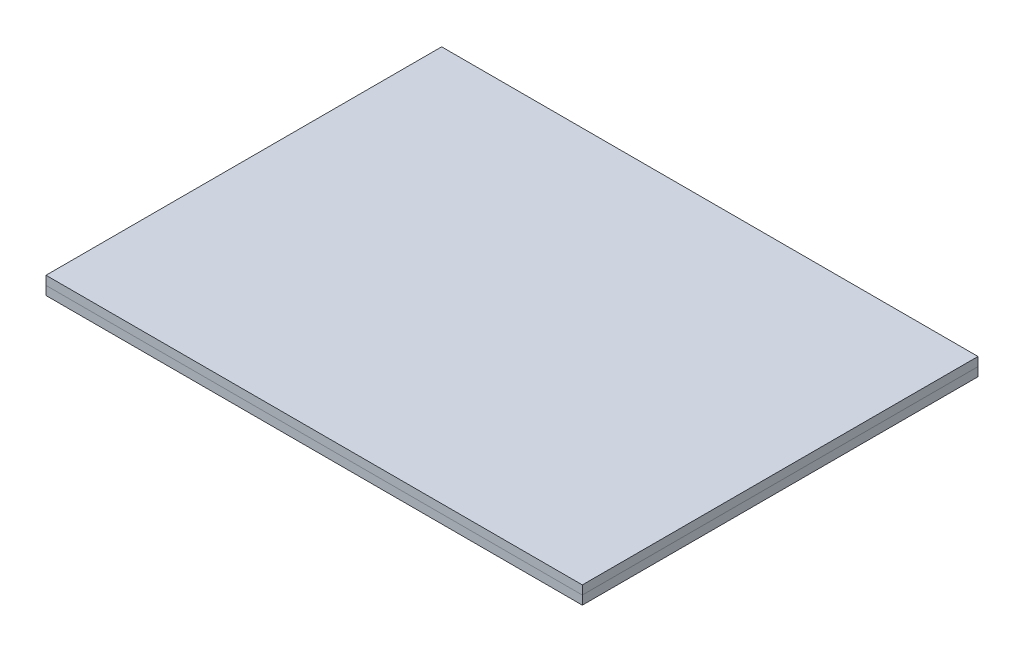
ISO-10303-21;
HEADER;
FILE_DESCRIPTION(('STEP AP214'),'2;1');
FILE_NAME('part.step','',(''),(''),'','','');
FILE_SCHEMA(('AUTOMOTIVE_DESIGN { 1 0 10303 214 1 1 1 1 }'));
ENDSEC;
DATA;
#1=APPLICATION_CONTEXT('core data for automotive mechanical design processes');
#2=APPLICATION_PROTOCOL_DEFINITION('international standard','automotive_design',2000,#1);
#3=PRODUCT_CONTEXT('',#1,'mechanical');
#4=PRODUCT('Part','Part','',(#3));
#5=PRODUCT_RELATED_PRODUCT_CATEGORY('part','',(#4));
#6=PRODUCT_DEFINITION_FORMATION('','',#4);
#7=PRODUCT_DEFINITION_CONTEXT('part definition',#1,'design');
#8=PRODUCT_DEFINITION('design','',#6,#7);
#9=PRODUCT_DEFINITION_SHAPE('','',#8);
#10=(LENGTH_UNIT() NAMED_UNIT(*) SI_UNIT(.MILLI.,.METRE.));
#11=(NAMED_UNIT(*) PLANE_ANGLE_UNIT() SI_UNIT($,.RADIAN.));
#12=(NAMED_UNIT(*) SI_UNIT($,.STERADIAN.) SOLID_ANGLE_UNIT());
#13=UNCERTAINTY_MEASURE_WITH_UNIT(LENGTH_MEASURE(1.E-05),#10,'distance_accuracy_value','');
#14=(GEOMETRIC_REPRESENTATION_CONTEXT(3) GLOBAL_UNCERTAINTY_ASSIGNED_CONTEXT((#13)) GLOBAL_UNIT_ASSIGNED_CONTEXT((#10,
#11,#12)) REPRESENTATION_CONTEXT('',''));
#15=CARTESIAN_POINT('',(0.,0.,0.));
#16=DIRECTION('',(0.,0.,1.));
#17=DIRECTION('',(1.,0.,0.));
#18=AXIS2_PLACEMENT_3D('',#15,#16,#17);
#19=CARTESIAN_POINT('',(0.,2.,29.9059304703476));
#20=DIRECTION('',(0.,0.,1.));
#21=DIRECTION('',(1.,0.,0.));
#22=AXIS2_PLACEMENT_3D('',#19,#20,#21);
#23=PLANE('',#22);
#24=DIRECTION('',(-1.,0.,0.));
#25=VECTOR('',#24,1.);
#26=CARTESIAN_POINT('',(0.,1.,29.9059304703476));
#27=LINE('',#26,#25);
#28=CARTESIAN_POINT('',(33.4314928425358,1.,29.9059304703476));
#29=VERTEX_POINT('',#28);
#30=CARTESIAN_POINT('',(-27.5685071574642,1.,29.9059304703476));
#31=VERTEX_POINT('',#30);
#32=EDGE_CURVE('E109',#29,#31,#27,.T.);
#33=ORIENTED_EDGE('',*,*,#32,.F.);
#34=DIRECTION('',(0.,-1.,0.));
#35=VECTOR('',#34,1.);
#36=CARTESIAN_POINT('',(33.4314928425358,2.,29.9059304703476));
#37=LINE('',#36,#35);
#38=CARTESIAN_POINT('',(33.4314928425358,2.,29.9059304703476));
#39=VERTEX_POINT('',#38);
#40=EDGE_CURVE('E12',#39,#29,#37,.T.);
#41=ORIENTED_EDGE('',*,*,#40,.F.);
#42=DIRECTION('',(-1.,0.,0.));
#43=VECTOR('',#42,1.);
#44=CARTESIAN_POINT('',(0.,2.,29.9059304703476));
#45=LINE('',#44,#43);
#46=CARTESIAN_POINT('',(-27.5685071574642,2.,29.9059304703476));
#47=VERTEX_POINT('',#46);
#48=EDGE_CURVE('E103',#39,#47,#45,.T.);
#49=ORIENTED_EDGE('',*,*,#48,.T.);
#50=DIRECTION('',(0.,-1.,0.));
#51=VECTOR('',#50,1.);
#52=CARTESIAN_POINT('',(-27.5685071574642,2.,29.9059304703476));
#53=LINE('',#52,#51);
#54=EDGE_CURVE('E48',#47,#31,#53,.T.);
#55=ORIENTED_EDGE('',*,*,#54,.T.);
#56=EDGE_LOOP('',(#33,#41,#49,#55));
#57=FACE_BOUND('',#56,.T.);
#58=ADVANCED_FACE('F45',(#57),#23,.T.);
#59=CARTESIAN_POINT('',(33.4314928425358,2.,0.));
#60=DIRECTION('',(1.,0.,0.));
#61=DIRECTION('',(0.,0.,-1.));
#62=AXIS2_PLACEMENT_3D('',#59,#60,#61);
#63=PLANE('',#62);
#64=DIRECTION('',(0.,0.,1.));
#65=VECTOR('',#64,1.);
#66=CARTESIAN_POINT('',(33.4314928425358,1.,0.));
#67=LINE('',#66,#65);
#68=CARTESIAN_POINT('',(33.4314928425358,1.,-15.0940695296524));
#69=VERTEX_POINT('',#68);
#70=EDGE_CURVE('E105',#69,#29,#67,.T.);
#71=ORIENTED_EDGE('',*,*,#70,.F.);
#72=DIRECTION('',(0.,-1.,0.));
#73=VECTOR('',#72,1.);
#74=CARTESIAN_POINT('',(33.4314928425358,2.,-15.0940695296524));
#75=LINE('',#74,#73);
#76=CARTESIAN_POINT('',(33.4314928425358,2.,-15.0940695296524));
#77=VERTEX_POINT('',#76);
#78=EDGE_CURVE('E54',#77,#69,#75,.T.);
#79=ORIENTED_EDGE('',*,*,#78,.F.);
#80=DIRECTION('',(0.,0.,1.));
#81=VECTOR('',#80,1.);
#82=CARTESIAN_POINT('',(33.4314928425358,2.,0.));
#83=LINE('',#82,#81);
#84=EDGE_CURVE('E100',#77,#39,#83,.T.);
#85=ORIENTED_EDGE('',*,*,#84,.T.);
#86=ORIENTED_EDGE('',*,*,#40,.T.);
#87=EDGE_LOOP('',(#71,#79,#85,#86));
#88=FACE_BOUND('',#87,.T.);
#89=ADVANCED_FACE('F119',(#88),#63,.T.);
#90=CARTESIAN_POINT('',(0.,2.,-15.0940695296524));
#91=DIRECTION('',(0.,0.,-1.));
#92=DIRECTION('',(-1.,0.,0.));
#93=AXIS2_PLACEMENT_3D('',#90,#91,#92);
#94=PLANE('',#93);
#95=DIRECTION('',(1.,0.,0.));
#96=VECTOR('',#95,1.);
#97=CARTESIAN_POINT('',(0.,1.,-15.0940695296524));
#98=LINE('',#97,#96);
#99=CARTESIAN_POINT('',(-27.5685071574642,1.,-15.0940695296524));
#100=VERTEX_POINT('',#99);
#101=EDGE_CURVE('E95',#100,#69,#98,.T.);
#102=ORIENTED_EDGE('',*,*,#101,.F.);
#103=DIRECTION('',(0.,-1.,0.));
#104=VECTOR('',#103,1.);
#105=CARTESIAN_POINT('',(-27.5685071574642,2.,-15.0940695296524));
#106=LINE('',#105,#104);
#107=CARTESIAN_POINT('',(-27.5685071574642,2.,-15.0940695296524));
#108=VERTEX_POINT('',#107);
#109=EDGE_CURVE('E90',#108,#100,#106,.T.);
#110=ORIENTED_EDGE('',*,*,#109,.F.);
#111=DIRECTION('',(1.,0.,0.));
#112=VECTOR('',#111,1.);
#113=CARTESIAN_POINT('',(0.,2.,-15.0940695296524));
#114=LINE('',#113,#112);
#115=EDGE_CURVE('E93',#108,#77,#114,.T.);
#116=ORIENTED_EDGE('',*,*,#115,.T.);
#117=ORIENTED_EDGE('',*,*,#78,.T.);
#118=EDGE_LOOP('',(#102,#110,#116,#117));
#119=FACE_BOUND('',#118,.T.);
#120=ADVANCED_FACE('F92',(#119),#94,.T.);
#121=CARTESIAN_POINT('',(-27.5685071574642,2.,0.));
#122=DIRECTION('',(-1.,0.,0.));
#123=DIRECTION('',(0.,0.,1.));
#124=AXIS2_PLACEMENT_3D('',#121,#122,#123);
#125=PLANE('',#124);
#126=DIRECTION('',(0.,0.,-1.));
#127=VECTOR('',#126,1.);
#128=CARTESIAN_POINT('',(-27.5685071574642,1.,0.));
#129=LINE('',#128,#127);
#130=EDGE_CURVE('E112',#31,#100,#129,.T.);
#131=ORIENTED_EDGE('',*,*,#130,.F.);
#132=ORIENTED_EDGE('',*,*,#54,.F.);
#133=DIRECTION('',(0.,0.,-1.));
#134=VECTOR('',#133,1.);
#135=CARTESIAN_POINT('',(-27.5685071574642,2.,0.));
#136=LINE('',#135,#134);
#137=EDGE_CURVE('E99',#47,#108,#136,.T.);
#138=ORIENTED_EDGE('',*,*,#137,.T.);
#139=ORIENTED_EDGE('',*,*,#109,.T.);
#140=EDGE_LOOP('',(#131,#132,#138,#139));
#141=FACE_BOUND('',#140,.T.);
#142=ADVANCED_FACE('F102',(#141),#125,.T.);
#143=CARTESIAN_POINT('',(0.,2.,0.));
#144=DIRECTION('',(0.,-1.,0.));
#145=DIRECTION('',(0.,0.,-1.));
#146=AXIS2_PLACEMENT_3D('',#143,#144,#145);
#147=PLANE('',#146);
#148=ORIENTED_EDGE('',*,*,#48,.F.);
#149=ORIENTED_EDGE('',*,*,#84,.F.);
#150=ORIENTED_EDGE('',*,*,#115,.F.);
#151=ORIENTED_EDGE('',*,*,#137,.F.);
#152=EDGE_LOOP('',(#148,#149,#150,#151));
#153=FACE_BOUND('',#152,.T.);
#154=ADVANCED_FACE('F98',(#153),#147,.F.);
#155=CARTESIAN_POINT('',(0.,1.,0.));
#156=DIRECTION('',(0.,-1.,0.));
#157=DIRECTION('',(0.,0.,-1.));
#158=AXIS2_PLACEMENT_3D('',#155,#156,#157);
#159=PLANE('',#158);
#160=ORIENTED_EDGE('',*,*,#32,.T.);
#161=ORIENTED_EDGE('',*,*,#130,.T.);
#162=ORIENTED_EDGE('',*,*,#101,.T.);
#163=ORIENTED_EDGE('',*,*,#70,.T.);
#164=EDGE_LOOP('',(#160,#161,#162,#163));
#165=FACE_BOUND('',#164,.T.);
#166=ADVANCED_FACE('F118',(#165),#159,.T.);
#167=CLOSED_SHELL('',(#58,#89,#120,#142,#154,#166));
#168=MANIFOLD_SOLID_BREP('B2',#167);
#169=CARTESIAN_POINT('',(-27.5685071574642,1.,-15.0940695296524));
#170=DIRECTION('',(1.,0.,0.));
#171=DIRECTION('',(0.,0.,-1.));
#172=AXIS2_PLACEMENT_3D('',#169,#170,#171);
#173=PLANE('',#172);
#174=DIRECTION('',(0.,0.,1.));
#175=VECTOR('',#174,1.);
#176=CARTESIAN_POINT('',(-27.5685071574642,0.,-15.0940695296524));
#177=LINE('',#176,#175);
#178=CARTESIAN_POINT('',(-27.5685071574642,0.,-15.0940695296524));
#179=VERTEX_POINT('',#178);
#180=CARTESIAN_POINT('',(-27.5685071574642,0.,29.9059304703476));
#181=VERTEX_POINT('',#180);
#182=EDGE_CURVE('E244',#179,#181,#177,.T.);
#183=ORIENTED_EDGE('',*,*,#182,.T.);
#184=DIRECTION('',(0.,-1.,0.));
#185=VECTOR('',#184,1.);
#186=CARTESIAN_POINT('',(-27.5685071574642,1.,29.9059304703476));
#187=LINE('',#186,#185);
#188=CARTESIAN_POINT('',(-27.5685071574642,1.,29.9059304703476));
#189=VERTEX_POINT('',#188);
#190=EDGE_CURVE('E43',#189,#181,#187,.T.);
#191=ORIENTED_EDGE('',*,*,#190,.F.);
#192=DIRECTION('',(0.,0.,1.));
#193=VECTOR('',#192,1.);
#194=CARTESIAN_POINT('',(-27.5685071574642,1.,-15.0940695296524));
#195=LINE('',#194,#193);
#196=CARTESIAN_POINT('',(-27.5685071574642,1.,-15.0940695296524));
#197=VERTEX_POINT('',#196);
#198=EDGE_CURVE('E232',#197,#189,#195,.T.);
#199=ORIENTED_EDGE('',*,*,#198,.F.);
#200=DIRECTION('',(0.,-1.,0.));
#201=VECTOR('',#200,1.);
#202=CARTESIAN_POINT('',(-27.5685071574642,1.,-15.0940695296524));
#203=LINE('',#202,#201);
#204=EDGE_CURVE('E240',#197,#179,#203,.T.);
#205=ORIENTED_EDGE('',*,*,#204,.T.);
#206=EDGE_LOOP('',(#183,#191,#199,#205));
#207=FACE_BOUND('',#206,.T.);
#208=ADVANCED_FACE('F181',(#207),#173,.F.);
#209=CARTESIAN_POINT('',(-27.5685071574642,1.,29.9059304703476));
#210=DIRECTION('',(0.,0.,-1.));
#211=DIRECTION('',(-1.,0.,0.));
#212=AXIS2_PLACEMENT_3D('',#209,#210,#211);
#213=PLANE('',#212);
#214=DIRECTION('',(1.,0.,0.));
#215=VECTOR('',#214,1.);
#216=CARTESIAN_POINT('',(-27.5685071574642,0.,29.9059304703476));
#217=LINE('',#216,#215);
#218=CARTESIAN_POINT('',(33.4314928425358,0.,29.9059304703476));
#219=VERTEX_POINT('',#218);
#220=EDGE_CURVE('E236',#181,#219,#217,.T.);
#221=ORIENTED_EDGE('',*,*,#220,.T.);
#222=DIRECTION('',(0.,-1.,0.));
#223=VECTOR('',#222,1.);
#224=CARTESIAN_POINT('',(33.4314928425358,1.,29.9059304703476));
#225=LINE('',#224,#223);
#226=CARTESIAN_POINT('',(33.4314928425358,1.,29.9059304703476));
#227=VERTEX_POINT('',#226);
#228=EDGE_CURVE('E189',#227,#219,#225,.T.);
#229=ORIENTED_EDGE('',*,*,#228,.F.);
#230=DIRECTION('',(1.,0.,0.));
#231=VECTOR('',#230,1.);
#232=CARTESIAN_POINT('',(-27.5685071574642,1.,29.9059304703476));
#233=LINE('',#232,#231);
#234=EDGE_CURVE('E227',#189,#227,#233,.T.);
#235=ORIENTED_EDGE('',*,*,#234,.F.);
#236=ORIENTED_EDGE('',*,*,#190,.T.);
#237=EDGE_LOOP('',(#221,#229,#235,#236));
#238=FACE_BOUND('',#237,.T.);
#239=ADVANCED_FACE('F235',(#238),#213,.F.);
#240=CARTESIAN_POINT('',(33.4314928425358,1.,-15.0940695296524));
#241=DIRECTION('',(-1.,0.,0.));
#242=DIRECTION('',(0.,0.,1.));
#243=AXIS2_PLACEMENT_3D('',#240,#241,#242);
#244=PLANE('',#243);
#245=DIRECTION('',(0.,0.,-1.));
#246=VECTOR('',#245,1.);
#247=CARTESIAN_POINT('',(33.4314928425358,0.,-15.0940695296524));
#248=LINE('',#247,#246);
#249=CARTESIAN_POINT('',(33.4314928425358,0.,-15.0940695296524));
#250=VERTEX_POINT('',#249);
#251=EDGE_CURVE('E214',#219,#250,#248,.T.);
#252=ORIENTED_EDGE('',*,*,#251,.T.);
#253=DIRECTION('',(0.,-1.,0.));
#254=VECTOR('',#253,1.);
#255=CARTESIAN_POINT('',(33.4314928425358,1.,-15.0940695296524));
#256=LINE('',#255,#254);
#257=CARTESIAN_POINT('',(33.4314928425358,1.,-15.0940695296524));
#258=VERTEX_POINT('',#257);
#259=EDGE_CURVE('E237',#258,#250,#256,.T.);
#260=ORIENTED_EDGE('',*,*,#259,.F.);
#261=DIRECTION('',(0.,0.,-1.));
#262=VECTOR('',#261,1.);
#263=CARTESIAN_POINT('',(33.4314928425358,1.,-15.0940695296524));
#264=LINE('',#263,#262);
#265=EDGE_CURVE('E230',#227,#258,#264,.T.);
#266=ORIENTED_EDGE('',*,*,#265,.F.);
#267=ORIENTED_EDGE('',*,*,#228,.T.);
#268=EDGE_LOOP('',(#252,#260,#266,#267));
#269=FACE_BOUND('',#268,.T.);
#270=ADVANCED_FACE('F238',(#269),#244,.F.);
#271=CARTESIAN_POINT('',(-27.5685071574642,1.,-15.0940695296524));
#272=DIRECTION('',(0.,0.,1.));
#273=DIRECTION('',(1.,0.,0.));
#274=AXIS2_PLACEMENT_3D('',#271,#272,#273);
#275=PLANE('',#274);
#276=DIRECTION('',(-1.,0.,0.));
#277=VECTOR('',#276,1.);
#278=CARTESIAN_POINT('',(-27.5685071574642,0.,-15.0940695296524));
#279=LINE('',#278,#277);
#280=EDGE_CURVE('E220',#250,#179,#279,.T.);
#281=ORIENTED_EDGE('',*,*,#280,.T.);
#282=ORIENTED_EDGE('',*,*,#204,.F.);
#283=DIRECTION('',(-1.,0.,0.));
#284=VECTOR('',#283,1.);
#285=CARTESIAN_POINT('',(-27.5685071574642,1.,-15.0940695296524));
#286=LINE('',#285,#284);
#287=EDGE_CURVE('E197',#258,#197,#286,.T.);
#288=ORIENTED_EDGE('',*,*,#287,.F.);
#289=ORIENTED_EDGE('',*,*,#259,.T.);
#290=EDGE_LOOP('',(#281,#282,#288,#289));
#291=FACE_BOUND('',#290,.T.);
#292=ADVANCED_FACE('F251',(#291),#275,.F.);
#293=CARTESIAN_POINT('',(0.,1.,0.));
#294=DIRECTION('',(0.,1.,0.));
#295=DIRECTION('',(0.,0.,1.));
#296=AXIS2_PLACEMENT_3D('',#293,#294,#295);
#297=PLANE('',#296);
#298=ORIENTED_EDGE('',*,*,#198,.T.);
#299=ORIENTED_EDGE('',*,*,#234,.T.);
#300=ORIENTED_EDGE('',*,*,#265,.T.);
#301=ORIENTED_EDGE('',*,*,#287,.T.);
#302=EDGE_LOOP('',(#298,#299,#300,#301));
#303=FACE_BOUND('',#302,.T.);
#304=ADVANCED_FACE('F228',(#303),#297,.T.);
#305=CARTESIAN_POINT('',(0.,0.,0.));
#306=DIRECTION('',(0.,1.,0.));
#307=DIRECTION('',(0.,0.,1.));
#308=AXIS2_PLACEMENT_3D('',#305,#306,#307);
#309=PLANE('',#308);
#310=ORIENTED_EDGE('',*,*,#182,.F.);
#311=ORIENTED_EDGE('',*,*,#280,.F.);
#312=ORIENTED_EDGE('',*,*,#251,.F.);
#313=ORIENTED_EDGE('',*,*,#220,.F.);
#314=EDGE_LOOP('',(#310,#311,#312,#313));
#315=FACE_BOUND('',#314,.T.);
#316=ADVANCED_FACE('F254',(#315),#309,.F.);
#317=CLOSED_SHELL('',(#208,#239,#270,#292,#304,#316));
#318=MANIFOLD_SOLID_BREP('B6',#317);
#319=ADVANCED_BREP_SHAPE_REPRESENTATION('',(#18,#168,#318),#14);
#320=SHAPE_DEFINITION_REPRESENTATION(#9,#319);
ENDSEC;
END-ISO-10303-21;
